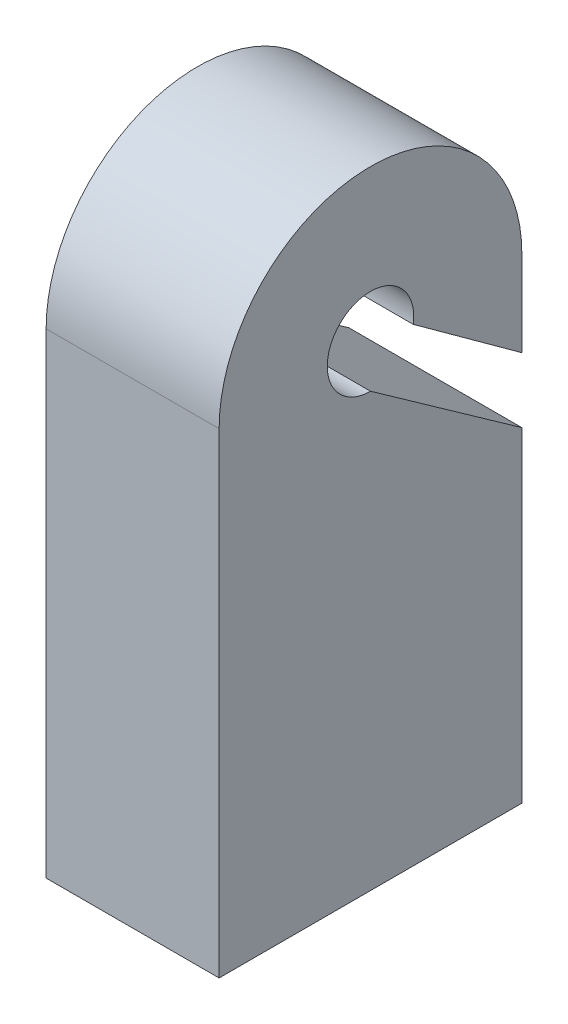
ISO-10303-21;
HEADER;
FILE_DESCRIPTION(('STEP AP214'),'2;1');
FILE_NAME('part.step','',(''),(''),'','','');
FILE_SCHEMA(('AUTOMOTIVE_DESIGN { 1 0 10303 214 1 1 1 1 }'));
ENDSEC;
DATA;
#1=APPLICATION_CONTEXT('core data for automotive mechanical design processes');
#2=APPLICATION_PROTOCOL_DEFINITION('international standard','automotive_design',2000,#1);
#3=PRODUCT_CONTEXT('',#1,'mechanical');
#4=PRODUCT('Part','Part','',(#3));
#5=PRODUCT_RELATED_PRODUCT_CATEGORY('part','',(#4));
#6=PRODUCT_DEFINITION_FORMATION('','',#4);
#7=PRODUCT_DEFINITION_CONTEXT('part definition',#1,'design');
#8=PRODUCT_DEFINITION('design','',#6,#7);
#9=PRODUCT_DEFINITION_SHAPE('','',#8);
#10=(LENGTH_UNIT() NAMED_UNIT(*) SI_UNIT(.MILLI.,.METRE.));
#11=(NAMED_UNIT(*) PLANE_ANGLE_UNIT() SI_UNIT($,.RADIAN.));
#12=(NAMED_UNIT(*) SI_UNIT($,.STERADIAN.) SOLID_ANGLE_UNIT());
#13=UNCERTAINTY_MEASURE_WITH_UNIT(LENGTH_MEASURE(1.E-05),#10,'distance_accuracy_value','');
#14=(GEOMETRIC_REPRESENTATION_CONTEXT(3) GLOBAL_UNCERTAINTY_ASSIGNED_CONTEXT((#13)) GLOBAL_UNIT_ASSIGNED_CONTEXT((#10,
#11,#12)) REPRESENTATION_CONTEXT('',''));
#15=CARTESIAN_POINT('',(0.,0.,0.));
#16=DIRECTION('',(0.,0.,1.));
#17=DIRECTION('',(1.,0.,0.));
#18=AXIS2_PLACEMENT_3D('',#15,#16,#17);
#19=CARTESIAN_POINT('',(2.,0.,-1.5));
#20=DIRECTION('',(0.,0.,1.));
#21=DIRECTION('',(1.,0.,0.));
#22=AXIS2_PLACEMENT_3D('',#19,#20,#21);
#23=PLANE('',#22);
#24=DIRECTION('',(0.,1.,0.));
#25=VECTOR('',#24,1.);
#26=CARTESIAN_POINT('',(0.,0.,-1.5));
#27=LINE('',#26,#25);
#28=CARTESIAN_POINT('',(0.,2.01064287094828,-1.5));
#29=VERTEX_POINT('',#28);
#30=CARTESIAN_POINT('',(0.,3.,-1.5));
#31=VERTEX_POINT('',#30);
#32=EDGE_CURVE('E131',#29,#31,#27,.T.);
#33=ORIENTED_EDGE('',*,*,#32,.T.);
#34=DIRECTION('',(-1.,0.,0.));
#35=VECTOR('',#34,1.);
#36=CARTESIAN_POINT('',(2.,3.,-1.5));
#37=LINE('',#36,#35);
#38=CARTESIAN_POINT('',(2.,3.,-1.5));
#39=VERTEX_POINT('',#38);
#40=EDGE_CURVE('E11',#39,#31,#37,.T.);
#41=ORIENTED_EDGE('',*,*,#40,.F.);
#42=DIRECTION('',(0.,1.,0.));
#43=VECTOR('',#42,1.);
#44=CARTESIAN_POINT('',(2.,0.,-1.5));
#45=LINE('',#44,#43);
#46=CARTESIAN_POINT('',(2.,2.01064287094828,-1.5));
#47=VERTEX_POINT('',#46);
#48=EDGE_CURVE('E149',#47,#39,#45,.T.);
#49=ORIENTED_EDGE('',*,*,#48,.F.);
#50=DIRECTION('',(-1.,0.,0.));
#51=VECTOR('',#50,1.);
#52=CARTESIAN_POINT('',(2.,2.01064287094828,-1.5));
#53=LINE('',#52,#51);
#54=EDGE_CURVE('E127',#47,#29,#53,.T.);
#55=ORIENTED_EDGE('',*,*,#54,.T.);
#56=EDGE_LOOP('',(#33,#41,#49,#55));
#57=FACE_BOUND('',#56,.T.);
#58=ADVANCED_FACE('F35',(#57),#23,.F.);
#59=CARTESIAN_POINT('',(2.,3.,0.250000000000001));
#60=DIRECTION('',(-1.,0.,0.));
#61=DIRECTION('',(0.,0.,1.));
#62=AXIS2_PLACEMENT_3D('',#59,#60,#61);
#63=CYLINDRICAL_SURFACE('',#62,1.75);
#64=CARTESIAN_POINT('',(0.,3.,0.250000000000001));
#65=DIRECTION('',(1.,0.,0.));
#66=DIRECTION('',(0.,0.,-1.));
#67=AXIS2_PLACEMENT_3D('',#64,#65,#66);
#68=CIRCLE('',#67,1.75);
#69=CARTESIAN_POINT('',(0.,3.,2.));
#70=VERTEX_POINT('',#69);
#71=EDGE_CURVE('E134',#31,#70,#68,.T.);
#72=ORIENTED_EDGE('',*,*,#71,.T.);
#73=DIRECTION('',(-1.,0.,0.));
#74=VECTOR('',#73,1.);
#75=CARTESIAN_POINT('',(2.,3.,2.));
#76=LINE('',#75,#74);
#77=CARTESIAN_POINT('',(2.,3.,2.));
#78=VERTEX_POINT('',#77);
#79=EDGE_CURVE('E43',#78,#70,#76,.T.);
#80=ORIENTED_EDGE('',*,*,#79,.F.);
#81=CARTESIAN_POINT('',(2.,3.,0.250000000000001));
#82=DIRECTION('',(1.,0.,0.));
#83=DIRECTION('',(0.,0.,-1.));
#84=AXIS2_PLACEMENT_3D('',#81,#82,#83);
#85=CIRCLE('',#84,1.75);
#86=EDGE_CURVE('E90',#39,#78,#85,.T.);
#87=ORIENTED_EDGE('',*,*,#86,.F.);
#88=ORIENTED_EDGE('',*,*,#40,.T.);
#89=EDGE_LOOP('',(#72,#80,#87,#88));
#90=FACE_BOUND('',#89,.T.);
#91=ADVANCED_FACE('F162',(#90),#63,.T.);
#92=CARTESIAN_POINT('',(2.,0.,2.));
#93=DIRECTION('',(0.,0.,1.));
#94=DIRECTION('',(0.,-1.,0.));
#95=AXIS2_PLACEMENT_3D('',#92,#93,#94);
#96=PLANE('',#95);
#97=DIRECTION('',(0.,1.,0.));
#98=VECTOR('',#97,1.);
#99=CARTESIAN_POINT('',(0.,0.,2.));
#100=LINE('',#99,#98);
#101=CARTESIAN_POINT('',(0.,-2.5,2.));
#102=VERTEX_POINT('',#101);
#103=EDGE_CURVE('E137',#102,#70,#100,.T.);
#104=ORIENTED_EDGE('',*,*,#103,.F.);
#105=DIRECTION('',(-1.,0.,0.));
#106=VECTOR('',#105,1.);
#107=CARTESIAN_POINT('',(2.,-2.5,2.));
#108=LINE('',#107,#106);
#109=CARTESIAN_POINT('',(2.,-2.5,2.));
#110=VERTEX_POINT('',#109);
#111=EDGE_CURVE('E155',#110,#102,#108,.T.);
#112=ORIENTED_EDGE('',*,*,#111,.F.);
#113=DIRECTION('',(0.,1.,0.));
#114=VECTOR('',#113,1.);
#115=CARTESIAN_POINT('',(2.,0.,2.));
#116=LINE('',#115,#114);
#117=EDGE_CURVE('E161',#110,#78,#116,.T.);
#118=ORIENTED_EDGE('',*,*,#117,.T.);
#119=ORIENTED_EDGE('',*,*,#79,.T.);
#120=EDGE_LOOP('',(#104,#112,#118,#119));
#121=FACE_BOUND('',#120,.T.);
#122=ADVANCED_FACE('F159',(#121),#96,.T.);
#123=CARTESIAN_POINT('',(2.,-2.5,0.));
#124=DIRECTION('',(0.,-1.,0.));
#125=DIRECTION('',(0.,0.,-1.));
#126=AXIS2_PLACEMENT_3D('',#123,#124,#125);
#127=PLANE('',#126);
#128=DIRECTION('',(0.,0.,1.));
#129=VECTOR('',#128,1.);
#130=CARTESIAN_POINT('',(0.,-2.5,0.));
#131=LINE('',#130,#129);
#132=CARTESIAN_POINT('',(0.,-2.5,-1.5));
#133=VERTEX_POINT('',#132);
#134=EDGE_CURVE('E140',#133,#102,#131,.T.);
#135=ORIENTED_EDGE('',*,*,#134,.F.);
#136=DIRECTION('',(-1.,0.,0.));
#137=VECTOR('',#136,1.);
#138=CARTESIAN_POINT('',(2.,-2.5,-1.5));
#139=LINE('',#138,#137);
#140=CARTESIAN_POINT('',(2.,-2.5,-1.5));
#141=VERTEX_POINT('',#140);
#142=EDGE_CURVE('E153',#141,#133,#139,.T.);
#143=ORIENTED_EDGE('',*,*,#142,.F.);
#144=DIRECTION('',(0.,0.,1.));
#145=VECTOR('',#144,1.);
#146=CARTESIAN_POINT('',(2.,-2.5,0.));
#147=LINE('',#146,#145);
#148=EDGE_CURVE('E172',#141,#110,#147,.T.);
#149=ORIENTED_EDGE('',*,*,#148,.T.);
#150=ORIENTED_EDGE('',*,*,#111,.T.);
#151=EDGE_LOOP('',(#135,#143,#149,#150));
#152=FACE_BOUND('',#151,.T.);
#153=ADVANCED_FACE('F170',(#152),#127,.T.);
#154=CARTESIAN_POINT('',(2.,0.,-1.5));
#155=DIRECTION('',(0.,0.,1.));
#156=DIRECTION('',(1.,0.,0.));
#157=AXIS2_PLACEMENT_3D('',#154,#155,#156);
#158=PLANE('',#157);
#159=DIRECTION('',(0.,1.,0.));
#160=VECTOR('',#159,1.);
#161=CARTESIAN_POINT('',(0.,0.,-1.5));
#162=LINE('',#161,#160);
#163=CARTESIAN_POINT('',(0.,1.26064287094828,-1.5));
#164=VERTEX_POINT('',#163);
#165=EDGE_CURVE('E143',#133,#164,#162,.T.);
#166=ORIENTED_EDGE('',*,*,#165,.T.);
#167=DIRECTION('',(-1.,0.,0.));
#168=VECTOR('',#167,1.);
#169=CARTESIAN_POINT('',(2.,1.26064287094828,-1.5));
#170=LINE('',#169,#168);
#171=CARTESIAN_POINT('',(2.,1.26064287094828,-1.5));
#172=VERTEX_POINT('',#171);
#173=EDGE_CURVE('E123',#172,#164,#170,.T.);
#174=ORIENTED_EDGE('',*,*,#173,.F.);
#175=DIRECTION('',(0.,1.,0.));
#176=VECTOR('',#175,1.);
#177=CARTESIAN_POINT('',(2.,0.,-1.5));
#178=LINE('',#177,#176);
#179=EDGE_CURVE('E110',#141,#172,#178,.T.);
#180=ORIENTED_EDGE('',*,*,#179,.F.);
#181=ORIENTED_EDGE('',*,*,#142,.T.);
#182=EDGE_LOOP('',(#166,#174,#180,#181));
#183=FACE_BOUND('',#182,.T.);
#184=ADVANCED_FACE('F200',(#183),#158,.F.);
#185=CARTESIAN_POINT('',(2.,1.54703095128144,-1.09561362190532));
#186=DIRECTION('',(0.,-0.816074233051313,0.577947096324319));
#187=DIRECTION('',(0.,-0.577947096324319,-0.816074233051313));
#188=AXIS2_PLACEMENT_3D('',#185,#186,#187);
#189=PLANE('',#188);
#190=DIRECTION('',(0.,0.577947096324319,0.816074233051313));
#191=VECTOR('',#190,1.);
#192=CARTESIAN_POINT('',(0.,1.54703095128144,-1.09561362190532));
#193=LINE('',#192,#191);
#194=CARTESIAN_POINT('',(0.,2.5,0.250000000000001));
#195=VERTEX_POINT('',#194);
#196=EDGE_CURVE('E119',#164,#195,#193,.T.);
#197=ORIENTED_EDGE('',*,*,#196,.T.);
#198=DIRECTION('',(-1.,0.,0.));
#199=VECTOR('',#198,1.);
#200=CARTESIAN_POINT('',(2.,2.5,0.250000000000001));
#201=LINE('',#200,#199);
#202=CARTESIAN_POINT('',(2.,2.5,0.250000000000001));
#203=VERTEX_POINT('',#202);
#204=EDGE_CURVE('E116',#203,#195,#201,.T.);
#205=ORIENTED_EDGE('',*,*,#204,.F.);
#206=DIRECTION('',(0.,0.577947096324319,0.816074233051313));
#207=VECTOR('',#206,1.);
#208=CARTESIAN_POINT('',(2.,1.54703095128144,-1.09561362190532));
#209=LINE('',#208,#207);
#210=EDGE_CURVE('E103',#172,#203,#209,.T.);
#211=ORIENTED_EDGE('',*,*,#210,.F.);
#212=ORIENTED_EDGE('',*,*,#173,.T.);
#213=EDGE_LOOP('',(#197,#205,#211,#212));
#214=FACE_BOUND('',#213,.T.);
#215=ADVANCED_FACE('F117',(#214),#189,.F.);
#216=CARTESIAN_POINT('',(2.,3.,0.250000000000001));
#217=DIRECTION('',(-1.,0.,0.));
#218=DIRECTION('',(0.,0.,1.));
#219=AXIS2_PLACEMENT_3D('',#216,#217,#218);
#220=CYLINDRICAL_SURFACE('',#219,0.5);
#221=CARTESIAN_POINT('',(0.,3.,0.250000000000001));
#222=DIRECTION('',(1.,0.,0.));
#223=DIRECTION('',(0.,0.,-1.));
#224=AXIS2_PLACEMENT_3D('',#221,#222,#223);
#225=CIRCLE('',#224,0.5);
#226=CARTESIAN_POINT('',(0.,2.9225,-0.243957234991046));
#227=VERTEX_POINT('',#226);
#228=EDGE_CURVE('E146',#227,#195,#225,.T.);
#229=ORIENTED_EDGE('',*,*,#228,.F.);
#230=DIRECTION('',(-1.,0.,0.));
#231=VECTOR('',#230,1.);
#232=CARTESIAN_POINT('',(2.,2.9225,-0.243957234991046));
#233=LINE('',#232,#231);
#234=CARTESIAN_POINT('',(2.,2.9225,-0.243957234991046));
#235=VERTEX_POINT('',#234);
#236=EDGE_CURVE('E79',#235,#227,#233,.T.);
#237=ORIENTED_EDGE('',*,*,#236,.F.);
#238=CARTESIAN_POINT('',(2.,3.,0.250000000000001));
#239=DIRECTION('',(1.,0.,0.));
#240=DIRECTION('',(0.,0.,-1.));
#241=AXIS2_PLACEMENT_3D('',#238,#239,#240);
#242=CIRCLE('',#241,0.5);
#243=EDGE_CURVE('E107',#235,#203,#242,.T.);
#244=ORIENTED_EDGE('',*,*,#243,.T.);
#245=ORIENTED_EDGE('',*,*,#204,.T.);
#246=EDGE_LOOP('',(#229,#237,#244,#245));
#247=FACE_BOUND('',#246,.T.);
#248=ADVANCED_FACE('F125',(#247),#220,.F.);
#249=CARTESIAN_POINT('',(2.,2.02981210070273,-1.47359523594567));
#250=DIRECTION('',(0.,0.809234877252891,-0.587485245293444));
#251=DIRECTION('',(0.,0.587485245293444,0.809234877252891));
#252=AXIS2_PLACEMENT_3D('',#249,#250,#251);
#253=PLANE('',#252);
#254=DIRECTION('',(0.,-0.587485245293444,-0.809234877252891));
#255=VECTOR('',#254,1.);
#256=CARTESIAN_POINT('',(0.,2.02981210070273,-1.47359523594567));
#257=LINE('',#256,#255);
#258=EDGE_CURVE('E82',#227,#29,#257,.T.);
#259=ORIENTED_EDGE('',*,*,#258,.T.);
#260=ORIENTED_EDGE('',*,*,#54,.F.);
#261=DIRECTION('',(0.,-0.587485245293444,-0.809234877252891));
#262=VECTOR('',#261,1.);
#263=CARTESIAN_POINT('',(2.,2.02981210070273,-1.47359523594567));
#264=LINE('',#263,#262);
#265=EDGE_CURVE('E51',#235,#47,#264,.T.);
#266=ORIENTED_EDGE('',*,*,#265,.F.);
#267=ORIENTED_EDGE('',*,*,#236,.T.);
#268=EDGE_LOOP('',(#259,#260,#266,#267));
#269=FACE_BOUND('',#268,.T.);
#270=ADVANCED_FACE('F179',(#269),#253,.F.);
#271=CARTESIAN_POINT('',(2.,0.,0.));
#272=DIRECTION('',(1.,0.,0.));
#273=DIRECTION('',(0.,0.,-1.));
#274=AXIS2_PLACEMENT_3D('',#271,#272,#273);
#275=PLANE('',#274);
#276=ORIENTED_EDGE('',*,*,#48,.T.);
#277=ORIENTED_EDGE('',*,*,#86,.T.);
#278=ORIENTED_EDGE('',*,*,#117,.F.);
#279=ORIENTED_EDGE('',*,*,#148,.F.);
#280=ORIENTED_EDGE('',*,*,#179,.T.);
#281=ORIENTED_EDGE('',*,*,#210,.T.);
#282=ORIENTED_EDGE('',*,*,#243,.F.);
#283=ORIENTED_EDGE('',*,*,#265,.T.);
#284=EDGE_LOOP('',(#276,#277,#278,#279,#280,#281,#282,#283));
#285=FACE_BOUND('',#284,.T.);
#286=ADVANCED_FACE('F105',(#285),#275,.T.);
#287=CARTESIAN_POINT('',(0.,0.,0.));
#288=DIRECTION('',(1.,0.,0.));
#289=DIRECTION('',(0.,0.,-1.));
#290=AXIS2_PLACEMENT_3D('',#287,#288,#289);
#291=PLANE('',#290);
#292=ORIENTED_EDGE('',*,*,#32,.F.);
#293=ORIENTED_EDGE('',*,*,#258,.F.);
#294=ORIENTED_EDGE('',*,*,#228,.T.);
#295=ORIENTED_EDGE('',*,*,#196,.F.);
#296=ORIENTED_EDGE('',*,*,#165,.F.);
#297=ORIENTED_EDGE('',*,*,#134,.T.);
#298=ORIENTED_EDGE('',*,*,#103,.T.);
#299=ORIENTED_EDGE('',*,*,#71,.F.);
#300=EDGE_LOOP('',(#292,#293,#294,#295,#296,#297,#298,#299));
#301=FACE_BOUND('',#300,.T.);
#302=ADVANCED_FACE('F166',(#301),#291,.F.);
#303=CLOSED_SHELL('',(#58,#91,#122,#153,#184,#215,#248,#270,#286,#302));
#304=MANIFOLD_SOLID_BREP('B2',#303);
#305=ADVANCED_BREP_SHAPE_REPRESENTATION('',(#18,#304),#14);
#306=SHAPE_DEFINITION_REPRESENTATION(#9,#305);
ENDSEC;
END-ISO-10303-21;
